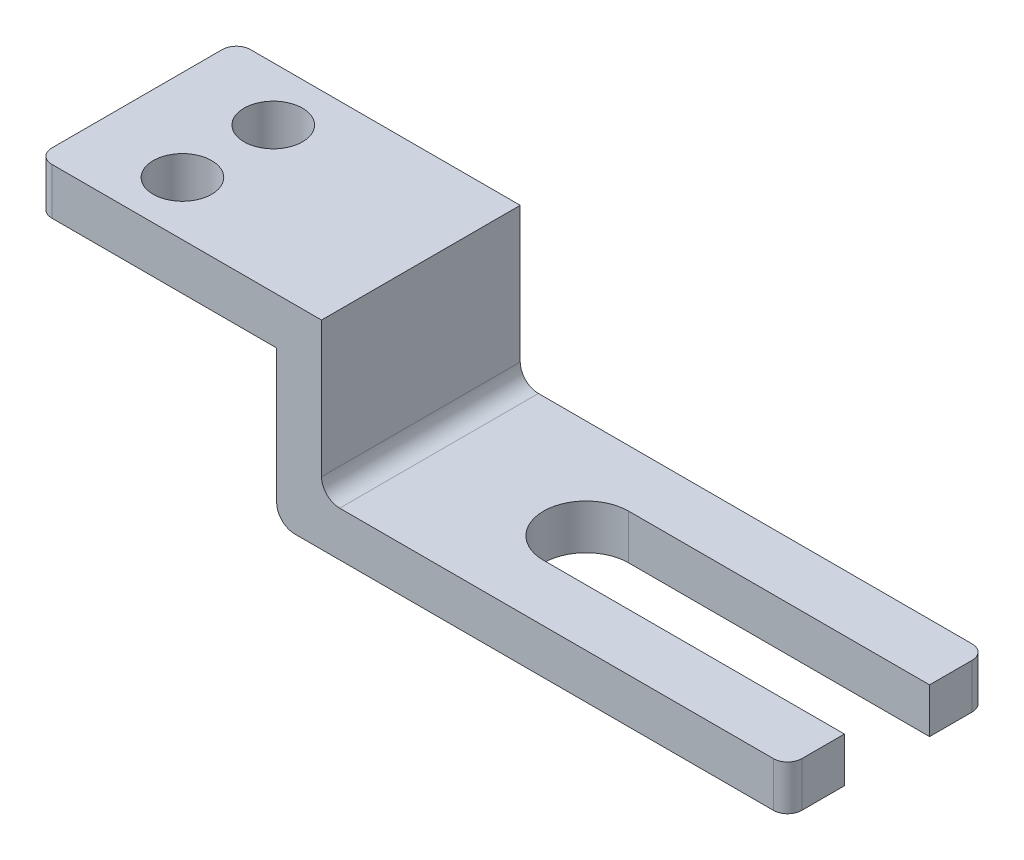
ISO-10303-21;
HEADER;
FILE_DESCRIPTION(('STEP AP214'),'2;1');
FILE_NAME('part.step','',(''),(''),'','','');
FILE_SCHEMA(('AUTOMOTIVE_DESIGN { 1 0 10303 214 1 1 1 1 }'));
ENDSEC;
DATA;
#1=APPLICATION_CONTEXT('core data for automotive mechanical design processes');
#2=APPLICATION_PROTOCOL_DEFINITION('international standard','automotive_design',2000,#1);
#3=PRODUCT_CONTEXT('',#1,'mechanical');
#4=PRODUCT('Part','Part','',(#3));
#5=PRODUCT_RELATED_PRODUCT_CATEGORY('part','',(#4));
#6=PRODUCT_DEFINITION_FORMATION('','',#4);
#7=PRODUCT_DEFINITION_CONTEXT('part definition',#1,'design');
#8=PRODUCT_DEFINITION('design','',#6,#7);
#9=PRODUCT_DEFINITION_SHAPE('','',#8);
#10=(LENGTH_UNIT() NAMED_UNIT(*) SI_UNIT(.MILLI.,.METRE.));
#11=(NAMED_UNIT(*) PLANE_ANGLE_UNIT() SI_UNIT($,.RADIAN.));
#12=(NAMED_UNIT(*) SI_UNIT($,.STERADIAN.) SOLID_ANGLE_UNIT());
#13=UNCERTAINTY_MEASURE_WITH_UNIT(LENGTH_MEASURE(1.E-05),#10,'distance_accuracy_value','');
#14=(GEOMETRIC_REPRESENTATION_CONTEXT(3) GLOBAL_UNCERTAINTY_ASSIGNED_CONTEXT((#13)) GLOBAL_UNIT_ASSIGNED_CONTEXT((#10,
#11,#12)) REPRESENTATION_CONTEXT('',''));
#15=CARTESIAN_POINT('',(0.,0.,0.));
#16=DIRECTION('',(0.,0.,1.));
#17=DIRECTION('',(1.,0.,0.));
#18=AXIS2_PLACEMENT_3D('',#15,#16,#17);
#19=CARTESIAN_POINT('',(6649.68579229798,35.3809816919192,-1778.));
#20=DIRECTION('',(1.,0.,0.));
#21=DIRECTION('',(0.,0.,-1.));
#22=AXIS2_PLACEMENT_3D('',#19,#20,#21);
#23=PLANE('',#22);
#24=DIRECTION('',(0.,0.,-1.));
#25=VECTOR('',#24,1.);
#26=CARTESIAN_POINT('',(6649.68579229798,-1341.29901830808,8957.8696252234));
#27=LINE('',#26,#25);
#28=CARTESIAN_POINT('',(6649.68579229798,-1341.29901830808,-127.000000000001));
#29=VERTEX_POINT('',#28);
#30=CARTESIAN_POINT('',(6649.68579229798,-1341.29901830808,-507.999999999999));
#31=VERTEX_POINT('',#30);
#32=EDGE_CURVE('E194',#29,#31,#27,.T.);
#33=ORIENTED_EDGE('',*,*,#32,.F.);
#34=DIRECTION('',(0.,1.,0.));
#35=VECTOR('',#34,1.);
#36=CARTESIAN_POINT('',(6649.68579229798,35.3809816919192,-127.));
#37=LINE('',#36,#35);
#38=CARTESIAN_POINT('',(6649.68579229798,-1742.61901830808,-127.));
#39=VERTEX_POINT('',#38);
#40=EDGE_CURVE('E11',#29,#39,#37,.F.);
#41=ORIENTED_EDGE('',*,*,#40,.T.);
#42=DIRECTION('',(0.,0.,1.));
#43=VECTOR('',#42,1.);
#44=CARTESIAN_POINT('',(6649.68579229798,-1742.61901830808,-1778.));
#45=LINE('',#44,#43);
#46=CARTESIAN_POINT('',(6649.68579229798,-1742.61901830808,-508.));
#47=VERTEX_POINT('',#46);
#48=EDGE_CURVE('E226',#47,#39,#45,.T.);
#49=ORIENTED_EDGE('',*,*,#48,.F.);
#50=DIRECTION('',(0.,-1.,0.));
#51=VECTOR('',#50,1.);
#52=CARTESIAN_POINT('',(6649.68579229798,9337.42060691532,-508.));
#53=LINE('',#52,#51);
#54=EDGE_CURVE('E184',#31,#47,#53,.T.);
#55=ORIENTED_EDGE('',*,*,#54,.F.);
#56=EDGE_LOOP('',(#33,#41,#49,#55));
#57=FACE_BOUND('',#56,.T.);
#58=ADVANCED_FACE('F26',(#57),#23,.T.);
#59=CARTESIAN_POINT('',(-60.9942077020202,35.3809816919192,-1778.));
#60=DIRECTION('',(0.,1.,0.));
#61=DIRECTION('',(0.,0.,1.));
#62=AXIS2_PLACEMENT_3D('',#59,#60,#61);
#63=PLANE('',#62);
#64=CARTESIAN_POINT('',(751.805792297979,35.3809816919192,-482.6));
#65=DIRECTION('',(0.,1.,0.));
#66=DIRECTION('',(0.,0.,1.));
#67=AXIS2_PLACEMENT_3D('',#64,#65,#66);
#68=CIRCLE('',#67,261.62);
#69=CARTESIAN_POINT('',(751.805792297979,35.3809816919192,-220.98));
#70=VERTEX_POINT('',#69);
#71=EDGE_CURVE('E245',#70,#70,#68,.T.);
#72=ORIENTED_EDGE('',*,*,#71,.F.);
#73=EDGE_LOOP('',(#72));
#74=FACE_BOUND('',#73,.T.);
#75=CARTESIAN_POINT('',(751.805792297979,35.3809816919192,-1295.4));
#76=DIRECTION('',(0.,1.,0.));
#77=DIRECTION('',(0.,0.,1.));
#78=AXIS2_PLACEMENT_3D('',#75,#76,#77);
#79=CIRCLE('',#78,261.62);
#80=CARTESIAN_POINT('',(751.805792297979,35.3809816919192,-1033.78));
#81=VERTEX_POINT('',#80);
#82=EDGE_CURVE('E179',#81,#81,#79,.T.);
#83=ORIENTED_EDGE('',*,*,#82,.F.);
#84=EDGE_LOOP('',(#83));
#85=FACE_BOUND('',#84,.T.);
#86=DIRECTION('',(-1.,0.,0.));
#87=VECTOR('',#86,1.);
#88=CARTESIAN_POINT('',(-60.9942077020202,35.3809816919192,-1778.));
#89=LINE('',#88,#87);
#90=CARTESIAN_POINT('',(2479.00579229798,35.3809816919192,-1778.));
#91=VERTEX_POINT('',#90);
#92=CARTESIAN_POINT('',(66.0057922979798,35.3809816919192,-1778.));
#93=VERTEX_POINT('',#92);
#94=EDGE_CURVE('E223',#91,#93,#89,.T.);
#95=ORIENTED_EDGE('',*,*,#94,.T.);
#96=CARTESIAN_POINT('',(66.0057922979798,35.3809816919192,-1651.));
#97=DIRECTION('',(0.,1.,0.));
#98=DIRECTION('',(0.,0.,1.));
#99=AXIS2_PLACEMENT_3D('',#96,#97,#98);
#100=CIRCLE('',#99,127.);
#101=CARTESIAN_POINT('',(-60.9942077020202,35.3809816919192,-1651.));
#102=VERTEX_POINT('',#101);
#103=EDGE_CURVE('E280',#93,#102,#100,.T.);
#104=ORIENTED_EDGE('',*,*,#103,.T.);
#105=DIRECTION('',(0.,0.,1.));
#106=VECTOR('',#105,1.);
#107=CARTESIAN_POINT('',(-60.9942077020202,35.3809816919192,-1778.));
#108=LINE('',#107,#106);
#109=CARTESIAN_POINT('',(-60.9942077020202,35.3809816919192,-127.));
#110=VERTEX_POINT('',#109);
#111=EDGE_CURVE('E227',#102,#110,#108,.T.);
#112=ORIENTED_EDGE('',*,*,#111,.T.);
#113=CARTESIAN_POINT('',(66.0057922979798,35.3809816919193,-127.));
#114=DIRECTION('',(0.,1.,0.));
#115=DIRECTION('',(0.,0.,1.));
#116=AXIS2_PLACEMENT_3D('',#113,#114,#115);
#117=CIRCLE('',#116,127.);
#118=CARTESIAN_POINT('',(66.0057922979798,35.3809816919192,0.));
#119=VERTEX_POINT('',#118);
#120=EDGE_CURVE('E278',#110,#119,#117,.T.);
#121=ORIENTED_EDGE('',*,*,#120,.T.);
#122=DIRECTION('',(-1.,0.,0.));
#123=VECTOR('',#122,1.);
#124=CARTESIAN_POINT('',(-60.9942077020202,35.3809816919192,0.));
#125=LINE('',#124,#123);
#126=CARTESIAN_POINT('',(2479.00579229798,35.3809816919192,0.));
#127=VERTEX_POINT('',#126);
#128=EDGE_CURVE('E217',#127,#119,#125,.T.);
#129=ORIENTED_EDGE('',*,*,#128,.F.);
#130=DIRECTION('',(0.,0.,-1.));
#131=VECTOR('',#130,1.);
#132=CARTESIAN_POINT('',(2479.00579229798,35.3809816919192,8957.8696252234));
#133=LINE('',#132,#131);
#134=EDGE_CURVE('E196',#127,#91,#133,.T.);
#135=ORIENTED_EDGE('',*,*,#134,.T.);
#136=EDGE_LOOP('',(#95,#104,#112,#121,#129,#135));
#137=FACE_BOUND('',#136,.T.);
#138=ADVANCED_FACE('F343',(#74,#85,#137),#63,.T.);
#139=CARTESIAN_POINT('',(6649.68579229798,-1742.61901830808,-1651.));
#140=VERTEX_POINT('',#139);
#141=CARTESIAN_POINT('',(6649.68579229798,-1742.61901830808,-1270.));
#142=VERTEX_POINT('',#141);
#143=EDGE_CURVE('E231',#140,#142,#45,.T.);
#144=ORIENTED_EDGE('',*,*,#143,.F.);
#145=DIRECTION('',(0.,1.,0.));
#146=VECTOR('',#145,1.);
#147=CARTESIAN_POINT('',(6649.68579229798,-1341.29901830808,-1651.));
#148=LINE('',#147,#146);
#149=CARTESIAN_POINT('',(6649.68579229798,-1341.29901830808,-1651.));
#150=VERTEX_POINT('',#149);
#151=EDGE_CURVE('E288',#140,#150,#148,.T.);
#152=ORIENTED_EDGE('',*,*,#151,.T.);
#153=CARTESIAN_POINT('',(6649.68579229798,-1341.29901830808,-1270.));
#154=VERTEX_POINT('',#153);
#155=EDGE_CURVE('E193',#154,#150,#27,.T.);
#156=ORIENTED_EDGE('',*,*,#155,.F.);
#157=DIRECTION('',(0.,-1.,0.));
#158=VECTOR('',#157,1.);
#159=CARTESIAN_POINT('',(6649.68579229798,9337.42060691532,-1270.));
#160=LINE('',#159,#158);
#161=EDGE_CURVE('E168',#154,#142,#160,.T.);
#162=ORIENTED_EDGE('',*,*,#161,.T.);
#163=EDGE_LOOP('',(#144,#152,#156,#162));
#164=FACE_BOUND('',#163,.T.);
#165=ADVANCED_FACE('F304',(#164),#23,.T.);
#166=CARTESIAN_POINT('',(-60.99420770202,-1742.61901830808,-1778.));
#167=DIRECTION('',(0.,0.,1.));
#168=DIRECTION('',(1.,0.,0.));
#169=AXIS2_PLACEMENT_3D('',#166,#167,#168);
#170=PLANE('',#169);
#171=DIRECTION('',(-1.,0.,0.));
#172=VECTOR('',#171,1.);
#173=CARTESIAN_POINT('',(-60.99420770202,-382.051723334529,-1778.));
#174=LINE('',#173,#172);
#175=CARTESIAN_POINT('',(2077.68579229798,-382.051723334529,-1778.));
#176=VERTEX_POINT('',#175);
#177=CARTESIAN_POINT('',(66.0057922979799,-382.051723334529,-1778.));
#178=VERTEX_POINT('',#177);
#179=EDGE_CURVE('E211',#176,#178,#174,.T.);
#180=ORIENTED_EDGE('',*,*,#179,.T.);
#181=DIRECTION('',(0.,-1.,0.));
#182=VECTOR('',#181,1.);
#183=CARTESIAN_POINT('',(66.0057922979798,35.3809816919192,-1778.));
#184=LINE('',#183,#182);
#185=EDGE_CURVE('E276',#178,#93,#184,.F.);
#186=ORIENTED_EDGE('',*,*,#185,.T.);
#187=ORIENTED_EDGE('',*,*,#94,.F.);
#188=DIRECTION('',(0.,1.,0.));
#189=VECTOR('',#188,1.);
#190=CARTESIAN_POINT('',(2479.00579229798,-1742.61901830808,-1778.));
#191=LINE('',#190,#189);
#192=CARTESIAN_POINT('',(2479.00579229798,-1178.73901830808,-1778.));
#193=VERTEX_POINT('',#192);
#194=EDGE_CURVE('E201',#193,#91,#191,.T.);
#195=ORIENTED_EDGE('',*,*,#194,.F.);
#196=CARTESIAN_POINT('',(2641.56579229798,-1178.73901830808,-1778.));
#197=DIRECTION('',(0.,0.,1.));
#198=DIRECTION('',(1.,0.,0.));
#199=AXIS2_PLACEMENT_3D('',#196,#197,#198);
#200=CIRCLE('',#199,162.56);
#201=CARTESIAN_POINT('',(2641.56579229798,-1341.29901830808,-1778.));
#202=VERTEX_POINT('',#201);
#203=EDGE_CURVE('E251',#193,#202,#200,.T.);
#204=ORIENTED_EDGE('',*,*,#203,.T.);
#205=DIRECTION('',(-1.,0.,0.));
#206=VECTOR('',#205,1.);
#207=CARTESIAN_POINT('',(-60.99420770202,-1341.29901830808,-1778.));
#208=LINE('',#207,#206);
#209=CARTESIAN_POINT('',(6522.68579229798,-1341.29901830808,-1778.));
#210=VERTEX_POINT('',#209);
#211=EDGE_CURVE('E199',#210,#202,#208,.T.);
#212=ORIENTED_EDGE('',*,*,#211,.F.);
#213=DIRECTION('',(0.,1.,0.));
#214=VECTOR('',#213,1.);
#215=CARTESIAN_POINT('',(6522.68579229798,-1742.61901830808,-1778.));
#216=LINE('',#215,#214);
#217=CARTESIAN_POINT('',(6522.68579229798,-1742.61901830808,-1778.));
#218=VERTEX_POINT('',#217);
#219=EDGE_CURVE('E274',#210,#218,#216,.F.);
#220=ORIENTED_EDGE('',*,*,#219,.T.);
#221=DIRECTION('',(1.,0.,0.));
#222=VECTOR('',#221,1.);
#223=CARTESIAN_POINT('',(-60.99420770202,-1742.61901830808,-1778.));
#224=LINE('',#223,#222);
#225=CARTESIAN_POINT('',(2240.24579229798,-1742.61901830808,-1778.));
#226=VERTEX_POINT('',#225);
#227=EDGE_CURVE('E220',#226,#218,#224,.T.);
#228=ORIENTED_EDGE('',*,*,#227,.F.);
#229=CARTESIAN_POINT('',(2240.24579229798,-1580.05901830808,-1778.));
#230=DIRECTION('',(0.,0.,1.));
#231=DIRECTION('',(1.,0.,0.));
#232=AXIS2_PLACEMENT_3D('',#229,#230,#231);
#233=CIRCLE('',#232,162.56);
#234=CARTESIAN_POINT('',(2077.68579229798,-1580.05901830808,-1778.));
#235=VERTEX_POINT('',#234);
#236=EDGE_CURVE('E263',#226,#235,#233,.F.);
#237=ORIENTED_EDGE('',*,*,#236,.T.);
#238=DIRECTION('',(0.,1.,0.));
#239=VECTOR('',#238,1.);
#240=CARTESIAN_POINT('',(2077.68579229798,-1742.61901830808,-1778.));
#241=LINE('',#240,#239);
#242=EDGE_CURVE('E209',#235,#176,#241,.T.);
#243=ORIENTED_EDGE('',*,*,#242,.T.);
#244=EDGE_LOOP('',(#180,#186,#187,#195,#204,#212,#220,#228,#237,#243));
#245=FACE_BOUND('',#244,.T.);
#246=ADVANCED_FACE('F308',(#245),#170,.F.);
#247=CARTESIAN_POINT('',(-60.99420770202,-1742.61901830808,0.));
#248=DIRECTION('',(0.,0.,1.));
#249=DIRECTION('',(1.,0.,0.));
#250=AXIS2_PLACEMENT_3D('',#247,#248,#249);
#251=PLANE('',#250);
#252=ORIENTED_EDGE('',*,*,#128,.T.);
#253=DIRECTION('',(0.,-1.,0.));
#254=VECTOR('',#253,1.);
#255=CARTESIAN_POINT('',(66.00579229798,-1742.61901830808,0.));
#256=LINE('',#255,#254);
#257=CARTESIAN_POINT('',(66.0057922979798,-382.051723334529,0.));
#258=VERTEX_POINT('',#257);
#259=EDGE_CURVE('E285',#119,#258,#256,.T.);
#260=ORIENTED_EDGE('',*,*,#259,.T.);
#261=DIRECTION('',(-1.,0.,0.));
#262=VECTOR('',#261,1.);
#263=CARTESIAN_POINT('',(-60.99420770202,-382.051723334529,0.));
#264=LINE('',#263,#262);
#265=CARTESIAN_POINT('',(2077.68579229798,-382.051723334529,0.));
#266=VERTEX_POINT('',#265);
#267=EDGE_CURVE('E234',#266,#258,#264,.T.);
#268=ORIENTED_EDGE('',*,*,#267,.F.);
#269=DIRECTION('',(0.,1.,0.));
#270=VECTOR('',#269,1.);
#271=CARTESIAN_POINT('',(2077.68579229798,-1742.61901830808,0.));
#272=LINE('',#271,#270);
#273=CARTESIAN_POINT('',(2077.68579229798,-1580.05901830808,0.));
#274=VERTEX_POINT('',#273);
#275=EDGE_CURVE('E230',#274,#266,#272,.T.);
#276=ORIENTED_EDGE('',*,*,#275,.F.);
#277=CARTESIAN_POINT('',(2240.24579229798,-1580.05901830808,0.));
#278=DIRECTION('',(0.,0.,1.));
#279=DIRECTION('',(1.,0.,0.));
#280=AXIS2_PLACEMENT_3D('',#277,#278,#279);
#281=CIRCLE('',#280,162.56);
#282=CARTESIAN_POINT('',(2240.24579229798,-1742.61901830808,0.));
#283=VERTEX_POINT('',#282);
#284=EDGE_CURVE('E259',#274,#283,#281,.T.);
#285=ORIENTED_EDGE('',*,*,#284,.T.);
#286=DIRECTION('',(1.,0.,0.));
#287=VECTOR('',#286,1.);
#288=CARTESIAN_POINT('',(-60.99420770202,-1742.61901830808,0.));
#289=LINE('',#288,#287);
#290=CARTESIAN_POINT('',(6522.68579229798,-1742.61901830808,0.));
#291=VERTEX_POINT('',#290);
#292=EDGE_CURVE('E214',#283,#291,#289,.T.);
#293=ORIENTED_EDGE('',*,*,#292,.T.);
#294=DIRECTION('',(0.,1.,0.));
#295=VECTOR('',#294,1.);
#296=CARTESIAN_POINT('',(6522.68579229798,-1742.61901830808,0.));
#297=LINE('',#296,#295);
#298=CARTESIAN_POINT('',(6522.68579229798,-1341.29901830808,0.));
#299=VERTEX_POINT('',#298);
#300=EDGE_CURVE('E282',#291,#299,#297,.T.);
#301=ORIENTED_EDGE('',*,*,#300,.T.);
#302=DIRECTION('',(-1.,0.,0.));
#303=VECTOR('',#302,1.);
#304=CARTESIAN_POINT('',(-60.99420770202,-1341.29901830808,0.));
#305=LINE('',#304,#303);
#306=CARTESIAN_POINT('',(2641.56579229798,-1341.29901830808,0.));
#307=VERTEX_POINT('',#306);
#308=EDGE_CURVE('E237',#299,#307,#305,.T.);
#309=ORIENTED_EDGE('',*,*,#308,.T.);
#310=CARTESIAN_POINT('',(2641.56579229798,-1178.73901830808,0.));
#311=DIRECTION('',(0.,0.,1.));
#312=DIRECTION('',(1.,0.,0.));
#313=AXIS2_PLACEMENT_3D('',#310,#311,#312);
#314=CIRCLE('',#313,162.56);
#315=CARTESIAN_POINT('',(2479.00579229798,-1178.73901830808,0.));
#316=VERTEX_POINT('',#315);
#317=EDGE_CURVE('E254',#307,#316,#314,.F.);
#318=ORIENTED_EDGE('',*,*,#317,.T.);
#319=DIRECTION('',(0.,1.,0.));
#320=VECTOR('',#319,1.);
#321=CARTESIAN_POINT('',(2479.00579229798,-1742.61901830808,0.));
#322=LINE('',#321,#320);
#323=EDGE_CURVE('E169',#316,#127,#322,.T.);
#324=ORIENTED_EDGE('',*,*,#323,.T.);
#325=EDGE_LOOP('',(#252,#260,#268,#276,#285,#293,#301,#309,#318,#324));
#326=FACE_BOUND('',#325,.T.);
#327=ADVANCED_FACE('F317',(#326),#251,.T.);
#328=CARTESIAN_POINT('',(-60.9942077020202,35.3809816919192,-1778.));
#329=DIRECTION('',(-1.,0.,0.));
#330=DIRECTION('',(0.,-1.,0.));
#331=AXIS2_PLACEMENT_3D('',#328,#329,#330);
#332=PLANE('',#331);
#333=ORIENTED_EDGE('',*,*,#111,.F.);
#334=DIRECTION('',(0.,-1.,0.));
#335=VECTOR('',#334,1.);
#336=CARTESIAN_POINT('',(-60.9942077020201,-382.051723334529,-1651.));
#337=LINE('',#336,#335);
#338=CARTESIAN_POINT('',(-60.9942077020201,-382.051723334529,-1651.));
#339=VERTEX_POINT('',#338);
#340=EDGE_CURVE('E267',#102,#339,#337,.T.);
#341=ORIENTED_EDGE('',*,*,#340,.T.);
#342=DIRECTION('',(0.,0.,-1.));
#343=VECTOR('',#342,1.);
#344=CARTESIAN_POINT('',(-60.9942077020201,-382.051723334529,8957.8696252234));
#345=LINE('',#344,#343);
#346=CARTESIAN_POINT('',(-60.9942077020201,-382.051723334529,-127.000000000001));
#347=VERTEX_POINT('',#346);
#348=EDGE_CURVE('E206',#347,#339,#345,.T.);
#349=ORIENTED_EDGE('',*,*,#348,.F.);
#350=DIRECTION('',(0.,-1.,0.));
#351=VECTOR('',#350,1.);
#352=CARTESIAN_POINT('',(-60.9942077020202,35.3809816919192,-127.));
#353=LINE('',#352,#351);
#354=EDGE_CURVE('E265',#347,#110,#353,.F.);
#355=ORIENTED_EDGE('',*,*,#354,.T.);
#356=EDGE_LOOP('',(#333,#341,#349,#355));
#357=FACE_BOUND('',#356,.T.);
#358=ADVANCED_FACE('F28',(#357),#332,.T.);
#359=CARTESIAN_POINT('',(-60.99420770202,-1742.61901830808,-1778.));
#360=DIRECTION('',(0.,-1.,0.));
#361=DIRECTION('',(0.,0.,-1.));
#362=AXIS2_PLACEMENT_3D('',#359,#360,#361);
#363=PLANE('',#362);
#364=ORIENTED_EDGE('',*,*,#227,.T.);
#365=CARTESIAN_POINT('',(6522.68579229798,-1742.61901830808,-1651.));
#366=DIRECTION('',(0.,-1.,0.));
#367=DIRECTION('',(0.,0.,-1.));
#368=AXIS2_PLACEMENT_3D('',#365,#366,#367);
#369=CIRCLE('',#368,127.);
#370=EDGE_CURVE('E34',#218,#140,#369,.T.);
#371=ORIENTED_EDGE('',*,*,#370,.T.);
#372=ORIENTED_EDGE('',*,*,#143,.T.);
#373=DIRECTION('',(1.,0.,0.));
#374=VECTOR('',#373,1.);
#375=CARTESIAN_POINT('',(-60.9942077020199,-1742.61901830808,-1270.));
#376=LINE('',#375,#374);
#377=CARTESIAN_POINT('',(3957.28579229798,-1742.61901830808,-1270.));
#378=VERTEX_POINT('',#377);
#379=EDGE_CURVE('E187',#378,#142,#376,.T.);
#380=ORIENTED_EDGE('',*,*,#379,.F.);
#381=CARTESIAN_POINT('',(3957.28579229798,-1742.61901830808,-889.));
#382=DIRECTION('',(0.,-1.,0.));
#383=DIRECTION('',(0.,0.,-1.));
#384=AXIS2_PLACEMENT_3D('',#381,#382,#383);
#385=CIRCLE('',#384,381.);
#386=CARTESIAN_POINT('',(3957.28579229798,-1742.61901830808,-508.));
#387=VERTEX_POINT('',#386);
#388=EDGE_CURVE('E173',#387,#378,#385,.T.);
#389=ORIENTED_EDGE('',*,*,#388,.F.);
#390=DIRECTION('',(-1.,0.,0.));
#391=VECTOR('',#390,1.);
#392=CARTESIAN_POINT('',(-60.99420770202,-1742.61901830808,-508.));
#393=LINE('',#392,#391);
#394=EDGE_CURVE('E190',#47,#387,#393,.T.);
#395=ORIENTED_EDGE('',*,*,#394,.F.);
#396=ORIENTED_EDGE('',*,*,#48,.T.);
#397=CARTESIAN_POINT('',(6522.68579229798,-1742.61901830808,-127.));
#398=DIRECTION('',(0.,-1.,0.));
#399=DIRECTION('',(0.,0.,-1.));
#400=AXIS2_PLACEMENT_3D('',#397,#398,#399);
#401=CIRCLE('',#400,127.);
#402=EDGE_CURVE('E294',#39,#291,#401,.T.);
#403=ORIENTED_EDGE('',*,*,#402,.T.);
#404=ORIENTED_EDGE('',*,*,#292,.F.);
#405=DIRECTION('',(0.,0.,1.));
#406=VECTOR('',#405,1.);
#407=CARTESIAN_POINT('',(2240.24579229798,-1742.61901830808,-1778.));
#408=LINE('',#407,#406);
#409=EDGE_CURVE('E261',#283,#226,#408,.F.);
#410=ORIENTED_EDGE('',*,*,#409,.T.);
#411=EDGE_LOOP('',(#364,#371,#372,#380,#389,#395,#396,#403,#404,#410));
#412=FACE_BOUND('',#411,.T.);
#413=ADVANCED_FACE('F298',(#412),#363,.T.);
#414=CARTESIAN_POINT('',(-60.9942077020201,-382.051723334529,8957.8696252234));
#415=DIRECTION('',(0.,1.,0.));
#416=DIRECTION('',(0.,0.,1.));
#417=AXIS2_PLACEMENT_3D('',#414,#415,#416);
#418=PLANE('',#417);
#419=CARTESIAN_POINT('',(751.805792297979,-382.051723334529,-482.6));
#420=DIRECTION('',(0.,1.,0.));
#421=DIRECTION('',(0.,0.,1.));
#422=AXIS2_PLACEMENT_3D('',#419,#420,#421);
#423=CIRCLE('',#422,261.62);
#424=CARTESIAN_POINT('',(751.805792297979,-382.051723334529,-220.98));
#425=VERTEX_POINT('',#424);
#426=EDGE_CURVE('E242',#425,#425,#423,.T.);
#427=ORIENTED_EDGE('',*,*,#426,.T.);
#428=EDGE_LOOP('',(#427));
#429=FACE_BOUND('',#428,.T.);
#430=CARTESIAN_POINT('',(751.805792297979,-382.051723334529,-1295.4));
#431=DIRECTION('',(0.,1.,0.));
#432=DIRECTION('',(0.,0.,1.));
#433=AXIS2_PLACEMENT_3D('',#430,#431,#432);
#434=CIRCLE('',#433,261.62);
#435=CARTESIAN_POINT('',(751.805792297979,-382.051723334529,-1033.78));
#436=VERTEX_POINT('',#435);
#437=EDGE_CURVE('E174',#436,#436,#434,.T.);
#438=ORIENTED_EDGE('',*,*,#437,.T.);
#439=EDGE_LOOP('',(#438));
#440=FACE_BOUND('',#439,.T.);
#441=ORIENTED_EDGE('',*,*,#348,.T.);
#442=CARTESIAN_POINT('',(66.0057922979799,-382.051723334529,-1651.));
#443=DIRECTION('',(0.,1.,0.));
#444=DIRECTION('',(0.,0.,1.));
#445=AXIS2_PLACEMENT_3D('',#442,#443,#444);
#446=CIRCLE('',#445,127.);
#447=EDGE_CURVE('E272',#339,#178,#446,.F.);
#448=ORIENTED_EDGE('',*,*,#447,.T.);
#449=ORIENTED_EDGE('',*,*,#179,.F.);
#450=DIRECTION('',(0.,0.,-1.));
#451=VECTOR('',#450,1.);
#452=CARTESIAN_POINT('',(2077.68579229798,-382.051723334529,8957.8696252234));
#453=LINE('',#452,#451);
#454=EDGE_CURVE('E203',#266,#176,#453,.T.);
#455=ORIENTED_EDGE('',*,*,#454,.F.);
#456=ORIENTED_EDGE('',*,*,#267,.T.);
#457=CARTESIAN_POINT('',(66.0057922979799,-382.051723334529,-127.));
#458=DIRECTION('',(0.,1.,0.));
#459=DIRECTION('',(0.,0.,1.));
#460=AXIS2_PLACEMENT_3D('',#457,#458,#459);
#461=CIRCLE('',#460,127.);
#462=EDGE_CURVE('E270',#258,#347,#461,.F.);
#463=ORIENTED_EDGE('',*,*,#462,.T.);
#464=EDGE_LOOP('',(#441,#448,#449,#455,#456,#463));
#465=FACE_BOUND('',#464,.T.);
#466=ADVANCED_FACE('F361',(#429,#440,#465),#418,.F.);
#467=CARTESIAN_POINT('',(2077.68579229798,-382.051723334529,8957.8696252234));
#468=DIRECTION('',(1.,0.,0.));
#469=DIRECTION('',(0.,1.,0.));
#470=AXIS2_PLACEMENT_3D('',#467,#468,#469);
#471=PLANE('',#470);
#472=ORIENTED_EDGE('',*,*,#242,.F.);
#473=DIRECTION('',(0.,0.,1.));
#474=VECTOR('',#473,1.);
#475=CARTESIAN_POINT('',(2077.68579229798,-1580.05901830808,0.));
#476=LINE('',#475,#474);
#477=EDGE_CURVE('E256',#235,#274,#476,.T.);
#478=ORIENTED_EDGE('',*,*,#477,.T.);
#479=ORIENTED_EDGE('',*,*,#275,.T.);
#480=ORIENTED_EDGE('',*,*,#454,.T.);
#481=EDGE_LOOP('',(#472,#478,#479,#480));
#482=FACE_BOUND('',#481,.T.);
#483=ADVANCED_FACE('F364',(#482),#471,.F.);
#484=CARTESIAN_POINT('',(2479.00579229798,35.3809816919192,8957.8696252234));
#485=DIRECTION('',(1.,0.,0.));
#486=DIRECTION('',(0.,0.,-1.));
#487=AXIS2_PLACEMENT_3D('',#484,#485,#486);
#488=PLANE('',#487);
#489=ORIENTED_EDGE('',*,*,#323,.F.);
#490=DIRECTION('',(0.,0.,-1.));
#491=VECTOR('',#490,1.);
#492=CARTESIAN_POINT('',(2479.00579229798,-1178.73901830808,-1778.));
#493=LINE('',#492,#491);
#494=EDGE_CURVE('E240',#316,#193,#493,.T.);
#495=ORIENTED_EDGE('',*,*,#494,.T.);
#496=ORIENTED_EDGE('',*,*,#194,.T.);
#497=ORIENTED_EDGE('',*,*,#134,.F.);
#498=EDGE_LOOP('',(#489,#495,#496,#497));
#499=FACE_BOUND('',#498,.T.);
#500=ADVANCED_FACE('F336',(#499),#488,.T.);
#501=CARTESIAN_POINT('',(2479.00579229798,-1341.29901830808,8957.8696252234));
#502=DIRECTION('',(0.,1.,0.));
#503=DIRECTION('',(-1.,0.,0.));
#504=AXIS2_PLACEMENT_3D('',#501,#502,#503);
#505=PLANE('',#504);
#506=ORIENTED_EDGE('',*,*,#155,.T.);
#507=CARTESIAN_POINT('',(6522.68579229798,-1341.29901830808,-1651.));
#508=DIRECTION('',(0.,1.,0.));
#509=DIRECTION('',(-1.,0.,0.));
#510=AXIS2_PLACEMENT_3D('',#507,#508,#509);
#511=CIRCLE('',#510,127.);
#512=EDGE_CURVE('E292',#150,#210,#511,.T.);
#513=ORIENTED_EDGE('',*,*,#512,.T.);
#514=ORIENTED_EDGE('',*,*,#211,.T.);
#515=DIRECTION('',(0.,0.,-1.));
#516=VECTOR('',#515,1.);
#517=CARTESIAN_POINT('',(2641.56579229798,-1341.29901830808,0.));
#518=LINE('',#517,#516);
#519=EDGE_CURVE('E248',#202,#307,#518,.F.);
#520=ORIENTED_EDGE('',*,*,#519,.T.);
#521=ORIENTED_EDGE('',*,*,#308,.F.);
#522=CARTESIAN_POINT('',(6522.68579229798,-1341.29901830808,-127.));
#523=DIRECTION('',(0.,1.,0.));
#524=DIRECTION('',(-1.,0.,0.));
#525=AXIS2_PLACEMENT_3D('',#522,#523,#524);
#526=CIRCLE('',#525,127.);
#527=EDGE_CURVE('E47',#299,#29,#526,.T.);
#528=ORIENTED_EDGE('',*,*,#527,.T.);
#529=ORIENTED_EDGE('',*,*,#32,.T.);
#530=DIRECTION('',(1.,0.,0.));
#531=VECTOR('',#530,1.);
#532=CARTESIAN_POINT('',(2479.00579229798,-1341.29901830808,-507.999999999999));
#533=LINE('',#532,#531);
#534=CARTESIAN_POINT('',(3957.28579229798,-1341.29901830808,-508.));
#535=VERTEX_POINT('',#534);
#536=EDGE_CURVE('E155',#535,#31,#533,.T.);
#537=ORIENTED_EDGE('',*,*,#536,.F.);
#538=CARTESIAN_POINT('',(3957.28579229798,-1341.29901830808,-889.));
#539=DIRECTION('',(0.,1.,0.));
#540=DIRECTION('',(-1.,0.,0.));
#541=AXIS2_PLACEMENT_3D('',#538,#539,#540);
#542=CIRCLE('',#541,381.);
#543=CARTESIAN_POINT('',(3957.28579229798,-1341.29901830808,-1270.));
#544=VERTEX_POINT('',#543);
#545=EDGE_CURVE('E148',#544,#535,#542,.T.);
#546=ORIENTED_EDGE('',*,*,#545,.F.);
#547=DIRECTION('',(-1.,0.,0.));
#548=VECTOR('',#547,1.);
#549=CARTESIAN_POINT('',(2479.00579229798,-1341.29901830808,-1270.));
#550=LINE('',#549,#548);
#551=EDGE_CURVE('E152',#154,#544,#550,.T.);
#552=ORIENTED_EDGE('',*,*,#551,.F.);
#553=EDGE_LOOP('',(#506,#513,#514,#520,#521,#528,#529,#537,#546,#552));
#554=FACE_BOUND('',#553,.T.);
#555=ADVANCED_FACE('F151',(#554),#505,.T.);
#556=CARTESIAN_POINT('',(6649.68579229798,9337.42060691532,-508.));
#557=DIRECTION('',(0.,0.,1.));
#558=DIRECTION('',(1.,0.,0.));
#559=AXIS2_PLACEMENT_3D('',#556,#557,#558);
#560=PLANE('',#559);
#561=ORIENTED_EDGE('',*,*,#54,.T.);
#562=ORIENTED_EDGE('',*,*,#394,.T.);
#563=DIRECTION('',(0.,-1.,0.));
#564=VECTOR('',#563,1.);
#565=CARTESIAN_POINT('',(3957.28579229798,9337.42060691532,-508.));
#566=LINE('',#565,#564);
#567=EDGE_CURVE('E176',#535,#387,#566,.T.);
#568=ORIENTED_EDGE('',*,*,#567,.F.);
#569=ORIENTED_EDGE('',*,*,#536,.T.);
#570=EDGE_LOOP('',(#561,#562,#568,#569));
#571=FACE_BOUND('',#570,.T.);
#572=ADVANCED_FACE('F327',(#571),#560,.F.);
#573=CARTESIAN_POINT('',(3957.28579229798,9337.42060691532,-889.));
#574=DIRECTION('',(0.,-1.,0.));
#575=DIRECTION('',(1.,0.,0.));
#576=AXIS2_PLACEMENT_3D('',#573,#574,#575);
#577=CYLINDRICAL_SURFACE('',#576,381.);
#578=ORIENTED_EDGE('',*,*,#567,.T.);
#579=ORIENTED_EDGE('',*,*,#388,.T.);
#580=DIRECTION('',(0.,-1.,0.));
#581=VECTOR('',#580,1.);
#582=CARTESIAN_POINT('',(3957.28579229798,9337.42060691532,-1270.));
#583=LINE('',#582,#581);
#584=EDGE_CURVE('E166',#544,#378,#583,.T.);
#585=ORIENTED_EDGE('',*,*,#584,.F.);
#586=ORIENTED_EDGE('',*,*,#545,.T.);
#587=EDGE_LOOP('',(#578,#579,#585,#586));
#588=FACE_BOUND('',#587,.T.);
#589=ADVANCED_FACE('F172',(#588),#577,.F.);
#590=CARTESIAN_POINT('',(3957.28579229798,9337.42060691532,-1270.));
#591=DIRECTION('',(0.,0.,-1.));
#592=DIRECTION('',(-1.,0.,0.));
#593=AXIS2_PLACEMENT_3D('',#590,#591,#592);
#594=PLANE('',#593);
#595=ORIENTED_EDGE('',*,*,#584,.T.);
#596=ORIENTED_EDGE('',*,*,#379,.T.);
#597=ORIENTED_EDGE('',*,*,#161,.F.);
#598=ORIENTED_EDGE('',*,*,#551,.T.);
#599=EDGE_LOOP('',(#595,#596,#597,#598));
#600=FACE_BOUND('',#599,.T.);
#601=ADVANCED_FACE('F164',(#600),#594,.F.);
#602=CARTESIAN_POINT('',(751.805792297979,-1742.61901830808,-1295.4));
#603=DIRECTION('',(0.,1.,0.));
#604=DIRECTION('',(0.,0.,1.));
#605=AXIS2_PLACEMENT_3D('',#602,#603,#604);
#606=CYLINDRICAL_SURFACE('',#605,261.62);
#607=ORIENTED_EDGE('',*,*,#82,.T.);
#608=EDGE_LOOP('',(#607));
#609=FACE_BOUND('',#608,.T.);
#610=ORIENTED_EDGE('',*,*,#437,.F.);
#611=EDGE_LOOP('',(#610));
#612=FACE_BOUND('',#611,.T.);
#613=ADVANCED_FACE('F330',(#609,#612),#606,.F.);
#614=CARTESIAN_POINT('',(751.805792297979,-1742.61901830808,-482.6));
#615=DIRECTION('',(0.,1.,0.));
#616=DIRECTION('',(0.,0.,1.));
#617=AXIS2_PLACEMENT_3D('',#614,#615,#616);
#618=CYLINDRICAL_SURFACE('',#617,261.62);
#619=ORIENTED_EDGE('',*,*,#71,.T.);
#620=EDGE_LOOP('',(#619));
#621=FACE_BOUND('',#620,.T.);
#622=ORIENTED_EDGE('',*,*,#426,.F.);
#623=EDGE_LOOP('',(#622));
#624=FACE_BOUND('',#623,.T.);
#625=ADVANCED_FACE('F339',(#621,#624),#618,.F.);
#626=CARTESIAN_POINT('',(2641.56579229798,-1178.73901830808,8957.8696252234));
#627=DIRECTION('',(0.,0.,1.));
#628=DIRECTION('',(1.,0.,0.));
#629=AXIS2_PLACEMENT_3D('',#626,#627,#628);
#630=CYLINDRICAL_SURFACE('',#629,162.56);
#631=ORIENTED_EDGE('',*,*,#317,.F.);
#632=ORIENTED_EDGE('',*,*,#519,.F.);
#633=ORIENTED_EDGE('',*,*,#203,.F.);
#634=ORIENTED_EDGE('',*,*,#494,.F.);
#635=EDGE_LOOP('',(#631,#632,#633,#634));
#636=FACE_BOUND('',#635,.T.);
#637=ADVANCED_FACE('F315',(#636),#630,.F.);
#638=CARTESIAN_POINT('',(2240.24579229798,-1580.05901830808,8957.8696252234));
#639=DIRECTION('',(0.,0.,-1.));
#640=DIRECTION('',(-1.,0.,0.));
#641=AXIS2_PLACEMENT_3D('',#638,#639,#640);
#642=CYLINDRICAL_SURFACE('',#641,162.56);
#643=ORIENTED_EDGE('',*,*,#236,.F.);
#644=ORIENTED_EDGE('',*,*,#409,.F.);
#645=ORIENTED_EDGE('',*,*,#284,.F.);
#646=ORIENTED_EDGE('',*,*,#477,.F.);
#647=EDGE_LOOP('',(#643,#644,#645,#646));
#648=FACE_BOUND('',#647,.T.);
#649=ADVANCED_FACE('F400',(#648),#642,.T.);
#650=CARTESIAN_POINT('',(66.0057922979798,35.3809816919192,-1651.));
#651=DIRECTION('',(0.,1.,0.));
#652=DIRECTION('',(-1.,0.,0.));
#653=AXIS2_PLACEMENT_3D('',#650,#651,#652);
#654=CYLINDRICAL_SURFACE('',#653,127.);
#655=ORIENTED_EDGE('',*,*,#103,.F.);
#656=ORIENTED_EDGE('',*,*,#185,.F.);
#657=ORIENTED_EDGE('',*,*,#447,.F.);
#658=ORIENTED_EDGE('',*,*,#340,.F.);
#659=EDGE_LOOP('',(#655,#656,#657,#658));
#660=FACE_BOUND('',#659,.T.);
#661=ADVANCED_FACE('F392',(#660),#654,.T.);
#662=CARTESIAN_POINT('',(66.00579229798,-1742.61901830808,-127.));
#663=DIRECTION('',(0.,-1.,0.));
#664=DIRECTION('',(1.,0.,0.));
#665=AXIS2_PLACEMENT_3D('',#662,#663,#664);
#666=CYLINDRICAL_SURFACE('',#665,127.);
#667=ORIENTED_EDGE('',*,*,#120,.F.);
#668=ORIENTED_EDGE('',*,*,#354,.F.);
#669=ORIENTED_EDGE('',*,*,#462,.F.);
#670=ORIENTED_EDGE('',*,*,#259,.F.);
#671=EDGE_LOOP('',(#667,#668,#669,#670));
#672=FACE_BOUND('',#671,.T.);
#673=ADVANCED_FACE('F382',(#672),#666,.T.);
#674=CARTESIAN_POINT('',(6522.68579229798,35.3809816919192,-1651.));
#675=DIRECTION('',(0.,-1.,0.));
#676=DIRECTION('',(0.,0.,-1.));
#677=AXIS2_PLACEMENT_3D('',#674,#675,#676);
#678=CYLINDRICAL_SURFACE('',#677,127.);
#679=ORIENTED_EDGE('',*,*,#370,.F.);
#680=ORIENTED_EDGE('',*,*,#219,.F.);
#681=ORIENTED_EDGE('',*,*,#512,.F.);
#682=ORIENTED_EDGE('',*,*,#151,.F.);
#683=EDGE_LOOP('',(#679,#680,#681,#682));
#684=FACE_BOUND('',#683,.T.);
#685=ADVANCED_FACE('F305',(#684),#678,.T.);
#686=CARTESIAN_POINT('',(6522.68579229798,-1742.61901830808,-127.));
#687=DIRECTION('',(0.,1.,0.));
#688=DIRECTION('',(0.,0.,1.));
#689=AXIS2_PLACEMENT_3D('',#686,#687,#688);
#690=CYLINDRICAL_SURFACE('',#689,127.);
#691=ORIENTED_EDGE('',*,*,#402,.F.);
#692=ORIENTED_EDGE('',*,*,#40,.F.);
#693=ORIENTED_EDGE('',*,*,#527,.F.);
#694=ORIENTED_EDGE('',*,*,#300,.F.);
#695=EDGE_LOOP('',(#691,#692,#693,#694));
#696=FACE_BOUND('',#695,.T.);
#697=ADVANCED_FACE('F323',(#696),#690,.T.);
#698=CLOSED_SHELL('',(#58,#138,#165,#246,#327,#358,#413,#466,#483,#500,#555,#572,#589,#601,#613,
#625,#637,#649,#661,#673,#685,#697));
#699=MANIFOLD_SOLID_BREP('B2',#698);
#700=ADVANCED_BREP_SHAPE_REPRESENTATION('',(#18,#699),#14);
#701=SHAPE_DEFINITION_REPRESENTATION(#9,#700);
ENDSEC;
END-ISO-10303-21;
